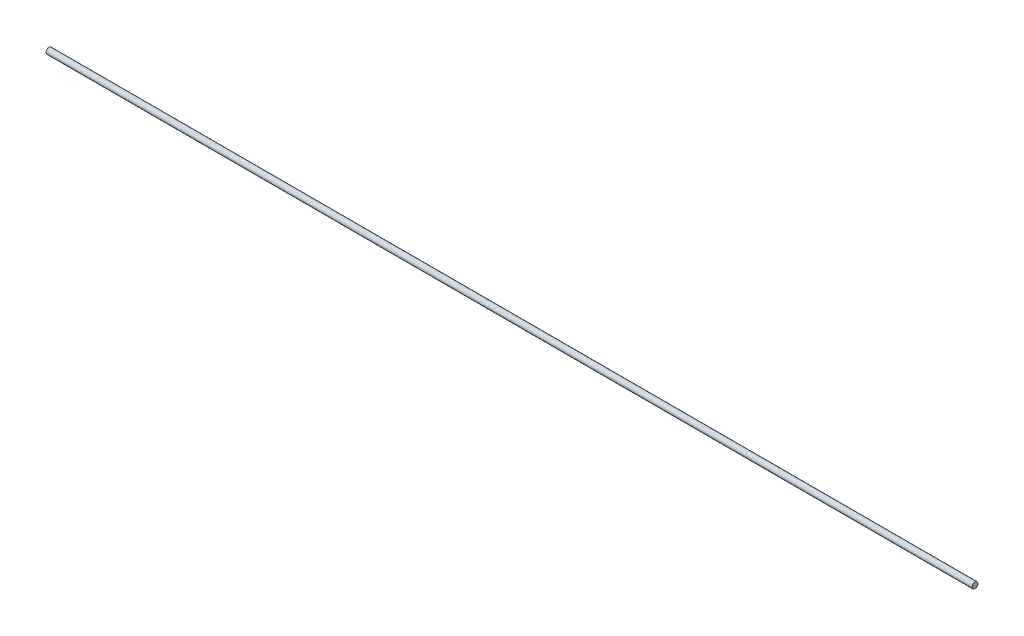
ISO-10303-21;
HEADER;
FILE_DESCRIPTION(('STEP AP214'),'2;1');
FILE_NAME('part.step','',(''),(''),'','','');
FILE_SCHEMA(('AUTOMOTIVE_DESIGN { 1 0 10303 214 1 1 1 1 }'));
ENDSEC;
DATA;
#1=APPLICATION_CONTEXT('core data for automotive mechanical design processes');
#2=APPLICATION_PROTOCOL_DEFINITION('international standard','automotive_design',2000,#1);
#3=PRODUCT_CONTEXT('',#1,'mechanical');
#4=PRODUCT('Part','Part','',(#3));
#5=PRODUCT_RELATED_PRODUCT_CATEGORY('part','',(#4));
#6=PRODUCT_DEFINITION_FORMATION('','',#4);
#7=PRODUCT_DEFINITION_CONTEXT('part definition',#1,'design');
#8=PRODUCT_DEFINITION('design','',#6,#7);
#9=PRODUCT_DEFINITION_SHAPE('','',#8);
#10=(LENGTH_UNIT() NAMED_UNIT(*) SI_UNIT(.MILLI.,.METRE.));
#11=(NAMED_UNIT(*) PLANE_ANGLE_UNIT() SI_UNIT($,.RADIAN.));
#12=(NAMED_UNIT(*) SI_UNIT($,.STERADIAN.) SOLID_ANGLE_UNIT());
#13=UNCERTAINTY_MEASURE_WITH_UNIT(LENGTH_MEASURE(1.E-05),#10,'distance_accuracy_value','');
#14=(GEOMETRIC_REPRESENTATION_CONTEXT(3) GLOBAL_UNCERTAINTY_ASSIGNED_CONTEXT((#13)) GLOBAL_UNIT_ASSIGNED_CONTEXT((#10,
#11,#12)) REPRESENTATION_CONTEXT('',''));
#15=CARTESIAN_POINT('',(0.,0.,0.));
#16=DIRECTION('',(0.,0.,1.));
#17=DIRECTION('',(1.,0.,0.));
#18=AXIS2_PLACEMENT_3D('',#15,#16,#17);
#19=CARTESIAN_POINT('',(495.3,0.,0.));
#20=DIRECTION('',(1.,0.,0.));
#21=DIRECTION('',(0.,0.,-1.));
#22=AXIS2_PLACEMENT_3D('',#19,#20,#21);
#23=PLANE('',#22);
#24=CARTESIAN_POINT('',(495.3,0.,0.));
#25=DIRECTION('',(1.,0.,0.));
#26=DIRECTION('',(0.,0.,-1.));
#27=AXIS2_PLACEMENT_3D('',#24,#25,#26);
#28=CIRCLE('',#27,3.175);
#29=CARTESIAN_POINT('',(495.3,0.,-3.175));
#30=VERTEX_POINT('',#29);
#31=EDGE_CURVE('E18',#30,#30,#28,.F.);
#32=ORIENTED_EDGE('',*,*,#31,.F.);
#33=EDGE_LOOP('',(#32));
#34=FACE_BOUND('',#33,.T.);
#35=ADVANCED_FACE('F15',(#34),#23,.T.);
#36=CARTESIAN_POINT('',(-495.3,0.,0.));
#37=DIRECTION('',(1.,0.,0.));
#38=DIRECTION('',(0.,0.,-1.));
#39=AXIS2_PLACEMENT_3D('',#36,#37,#38);
#40=PLANE('',#39);
#41=CARTESIAN_POINT('',(-495.3,0.,0.));
#42=DIRECTION('',(1.,0.,0.));
#43=DIRECTION('',(0.,0.,-1.));
#44=AXIS2_PLACEMENT_3D('',#41,#42,#43);
#45=CIRCLE('',#44,3.175);
#46=CARTESIAN_POINT('',(-495.3,0.,-3.175));
#47=VERTEX_POINT('',#46);
#48=EDGE_CURVE('E10',#47,#47,#45,.T.);
#49=ORIENTED_EDGE('',*,*,#48,.F.);
#50=EDGE_LOOP('',(#49));
#51=FACE_BOUND('',#50,.T.);
#52=ADVANCED_FACE('F30',(#51),#40,.F.);
#53=CARTESIAN_POINT('',(-495.3,0.,0.));
#54=DIRECTION('',(1.,0.,0.));
#55=DIRECTION('',(0.,0.,-1.));
#56=AXIS2_PLACEMENT_3D('',#53,#54,#55);
#57=CYLINDRICAL_SURFACE('',#56,3.175);
#58=ORIENTED_EDGE('',*,*,#31,.T.);
#59=EDGE_LOOP('',(#58));
#60=FACE_BOUND('',#59,.T.);
#61=ORIENTED_EDGE('',*,*,#48,.T.);
#62=EDGE_LOOP('',(#61));
#63=FACE_BOUND('',#62,.T.);
#64=ADVANCED_FACE('F27',(#60,#63),#57,.T.);
#65=CLOSED_SHELL('',(#35,#52,#64));
#66=MANIFOLD_SOLID_BREP('B1',#65);
#67=ADVANCED_BREP_SHAPE_REPRESENTATION('',(#18,#66),#14);
#68=SHAPE_DEFINITION_REPRESENTATION(#9,#67);
ENDSEC;
END-ISO-10303-21;
